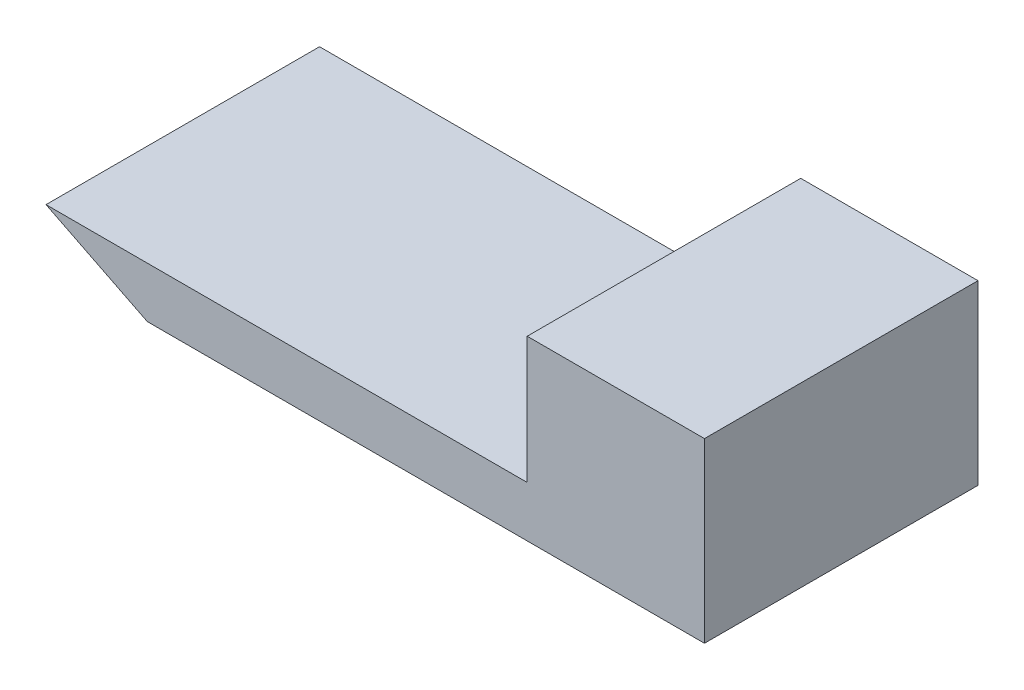
ISO-10303-21;
HEADER;
FILE_DESCRIPTION(('STEP AP214'),'2;1');
FILE_NAME('part.step','',(''),(''),'','','');
FILE_SCHEMA(('AUTOMOTIVE_DESIGN { 1 0 10303 214 1 1 1 1 }'));
ENDSEC;
DATA;
#1=APPLICATION_CONTEXT('core data for automotive mechanical design processes');
#2=APPLICATION_PROTOCOL_DEFINITION('international standard','automotive_design',2000,#1);
#3=PRODUCT_CONTEXT('',#1,'mechanical');
#4=PRODUCT('Part','Part','',(#3));
#5=PRODUCT_RELATED_PRODUCT_CATEGORY('part','',(#4));
#6=PRODUCT_DEFINITION_FORMATION('','',#4);
#7=PRODUCT_DEFINITION_CONTEXT('part definition',#1,'design');
#8=PRODUCT_DEFINITION('design','',#6,#7);
#9=PRODUCT_DEFINITION_SHAPE('','',#8);
#10=(LENGTH_UNIT() NAMED_UNIT(*) SI_UNIT(.MILLI.,.METRE.));
#11=(NAMED_UNIT(*) PLANE_ANGLE_UNIT() SI_UNIT($,.RADIAN.));
#12=(NAMED_UNIT(*) SI_UNIT($,.STERADIAN.) SOLID_ANGLE_UNIT());
#13=UNCERTAINTY_MEASURE_WITH_UNIT(LENGTH_MEASURE(1.E-05),#10,'distance_accuracy_value','');
#14=(GEOMETRIC_REPRESENTATION_CONTEXT(3) GLOBAL_UNCERTAINTY_ASSIGNED_CONTEXT((#13)) GLOBAL_UNIT_ASSIGNED_CONTEXT((#10,
#11,#12)) REPRESENTATION_CONTEXT('',''));
#15=CARTESIAN_POINT('',(0.,0.,0.));
#16=DIRECTION('',(0.,0.,1.));
#17=DIRECTION('',(1.,0.,0.));
#18=AXIS2_PLACEMENT_3D('',#15,#16,#17);
#19=CARTESIAN_POINT('',(-48.3861260844223,15.4542561887828,10.8));
#20=DIRECTION('',(0.,-1.,0.));
#21=DIRECTION('',(0.,0.,-1.));
#22=AXIS2_PLACEMENT_3D('',#19,#20,#21);
#23=PLANE('',#22);
#24=DIRECTION('',(-1.,0.,0.));
#25=VECTOR('',#24,1.);
#26=CARTESIAN_POINT('',(-48.3861260844223,15.4542561887828,0.));
#27=LINE('',#26,#25);
#28=CARTESIAN_POINT('',(-48.3861260844223,15.4542561887828,0.));
#29=VERTEX_POINT('',#28);
#30=CARTESIAN_POINT('',(-67.3861260844223,15.4542561887828,0.));
#31=VERTEX_POINT('',#30);
#32=EDGE_CURVE('E116',#29,#31,#27,.T.);
#33=ORIENTED_EDGE('',*,*,#32,.T.);
#34=DIRECTION('',(0.,0.,-1.));
#35=VECTOR('',#34,1.);
#36=CARTESIAN_POINT('',(-67.3861260844223,15.4542561887828,10.8));
#37=LINE('',#36,#35);
#38=CARTESIAN_POINT('',(-67.3861260844223,15.4542561887828,10.8));
#39=VERTEX_POINT('',#38);
#40=EDGE_CURVE('E11',#39,#31,#37,.T.);
#41=ORIENTED_EDGE('',*,*,#40,.F.);
#42=DIRECTION('',(-1.,0.,0.));
#43=VECTOR('',#42,1.);
#44=CARTESIAN_POINT('',(-48.3861260844223,15.4542561887828,10.8));
#45=LINE('',#44,#43);
#46=CARTESIAN_POINT('',(-48.3861260844223,15.4542561887828,10.8));
#47=VERTEX_POINT('',#46);
#48=EDGE_CURVE('E127',#47,#39,#45,.T.);
#49=ORIENTED_EDGE('',*,*,#48,.F.);
#50=DIRECTION('',(0.,0.,-1.));
#51=VECTOR('',#50,1.);
#52=CARTESIAN_POINT('',(-48.3861260844223,15.4542561887828,10.8));
#53=LINE('',#52,#51);
#54=EDGE_CURVE('E112',#47,#29,#53,.T.);
#55=ORIENTED_EDGE('',*,*,#54,.T.);
#56=EDGE_LOOP('',(#33,#41,#49,#55));
#57=FACE_BOUND('',#56,.T.);
#58=ADVANCED_FACE('F33',(#57),#23,.F.);
#59=CARTESIAN_POINT('',(-67.3861260844223,15.4542561887828,10.8));
#60=DIRECTION('',(0.447213595499958,0.894427190999916,0.));
#61=DIRECTION('',(-0.894427190999916,0.447213595499958,0.));
#62=AXIS2_PLACEMENT_3D('',#59,#60,#61);
#63=PLANE('',#62);
#64=DIRECTION('',(0.894427190999916,-0.447213595499958,0.));
#65=VECTOR('',#64,1.);
#66=CARTESIAN_POINT('',(-67.3861260844223,15.4542561887828,0.));
#67=LINE('',#66,#65);
#68=CARTESIAN_POINT('',(-63.3861260844223,13.4542561887828,0.));
#69=VERTEX_POINT('',#68);
#70=EDGE_CURVE('E119',#31,#69,#67,.T.);
#71=ORIENTED_EDGE('',*,*,#70,.T.);
#72=DIRECTION('',(0.,0.,-1.));
#73=VECTOR('',#72,1.);
#74=CARTESIAN_POINT('',(-63.3861260844223,13.4542561887828,10.8));
#75=LINE('',#74,#73);
#76=CARTESIAN_POINT('',(-63.3861260844223,13.4542561887828,10.8));
#77=VERTEX_POINT('',#76);
#78=EDGE_CURVE('E41',#77,#69,#75,.T.);
#79=ORIENTED_EDGE('',*,*,#78,.F.);
#80=DIRECTION('',(0.894427190999916,-0.447213595499958,0.));
#81=VECTOR('',#80,1.);
#82=CARTESIAN_POINT('',(-67.3861260844223,15.4542561887828,10.8));
#83=LINE('',#82,#81);
#84=EDGE_CURVE('E86',#39,#77,#83,.T.);
#85=ORIENTED_EDGE('',*,*,#84,.F.);
#86=ORIENTED_EDGE('',*,*,#40,.T.);
#87=EDGE_LOOP('',(#71,#79,#85,#86));
#88=FACE_BOUND('',#87,.T.);
#89=ADVANCED_FACE('F151',(#88),#63,.F.);
#90=CARTESIAN_POINT('',(-41.3861260844223,13.4542561887828,10.8));
#91=DIRECTION('',(0.,1.,0.));
#92=DIRECTION('',(-1.,0.,0.));
#93=AXIS2_PLACEMENT_3D('',#90,#91,#92);
#94=PLANE('',#93);
#95=DIRECTION('',(1.,0.,0.));
#96=VECTOR('',#95,1.);
#97=CARTESIAN_POINT('',(-41.3861260844223,13.4542561887828,0.));
#98=LINE('',#97,#96);
#99=CARTESIAN_POINT('',(-41.3861260844223,13.4542561887828,0.));
#100=VERTEX_POINT('',#99);
#101=EDGE_CURVE('E121',#69,#100,#98,.T.);
#102=ORIENTED_EDGE('',*,*,#101,.T.);
#103=DIRECTION('',(0.,0.,-1.));
#104=VECTOR('',#103,1.);
#105=CARTESIAN_POINT('',(-41.3861260844223,13.4542561887828,10.8));
#106=LINE('',#105,#104);
#107=CARTESIAN_POINT('',(-41.3861260844223,13.4542561887828,10.8));
#108=VERTEX_POINT('',#107);
#109=EDGE_CURVE('E107',#108,#100,#106,.T.);
#110=ORIENTED_EDGE('',*,*,#109,.F.);
#111=DIRECTION('',(1.,0.,0.));
#112=VECTOR('',#111,1.);
#113=CARTESIAN_POINT('',(-41.3861260844223,13.4542561887828,10.8));
#114=LINE('',#113,#112);
#115=EDGE_CURVE('E99',#77,#108,#114,.T.);
#116=ORIENTED_EDGE('',*,*,#115,.F.);
#117=ORIENTED_EDGE('',*,*,#78,.T.);
#118=EDGE_LOOP('',(#102,#110,#116,#117));
#119=FACE_BOUND('',#118,.T.);
#120=ADVANCED_FACE('F133',(#119),#94,.F.);
#121=CARTESIAN_POINT('',(-41.3861260844223,15.4542561887828,10.8));
#122=DIRECTION('',(-1.,0.,0.));
#123=DIRECTION('',(0.,0.,1.));
#124=AXIS2_PLACEMENT_3D('',#121,#122,#123);
#125=PLANE('',#124);
#126=DIRECTION('',(0.,1.,0.));
#127=VECTOR('',#126,1.);
#128=CARTESIAN_POINT('',(-41.3861260844223,15.4542561887828,0.));
#129=LINE('',#128,#127);
#130=CARTESIAN_POINT('',(-41.3861260844223,20.4542561887828,0.));
#131=VERTEX_POINT('',#130);
#132=EDGE_CURVE('E106',#100,#131,#129,.T.);
#133=ORIENTED_EDGE('',*,*,#132,.T.);
#134=DIRECTION('',(0.,0.,-1.));
#135=VECTOR('',#134,1.);
#136=CARTESIAN_POINT('',(-41.3861260844223,20.4542561887828,10.8));
#137=LINE('',#136,#135);
#138=CARTESIAN_POINT('',(-41.3861260844223,20.4542561887828,10.8));
#139=VERTEX_POINT('',#138);
#140=EDGE_CURVE('E104',#139,#131,#137,.T.);
#141=ORIENTED_EDGE('',*,*,#140,.F.);
#142=DIRECTION('',(0.,1.,0.));
#143=VECTOR('',#142,1.);
#144=CARTESIAN_POINT('',(-41.3861260844223,15.4542561887828,10.8));
#145=LINE('',#144,#143);
#146=EDGE_CURVE('E93',#108,#139,#145,.T.);
#147=ORIENTED_EDGE('',*,*,#146,.F.);
#148=ORIENTED_EDGE('',*,*,#109,.T.);
#149=EDGE_LOOP('',(#133,#141,#147,#148));
#150=FACE_BOUND('',#149,.T.);
#151=ADVANCED_FACE('F105',(#150),#125,.F.);
#152=CARTESIAN_POINT('',(-41.3861260844223,20.4542561887828,10.8));
#153=DIRECTION('',(0.,-1.,0.));
#154=DIRECTION('',(0.,0.,-1.));
#155=AXIS2_PLACEMENT_3D('',#152,#153,#154);
#156=PLANE('',#155);
#157=DIRECTION('',(-1.,0.,0.));
#158=VECTOR('',#157,1.);
#159=CARTESIAN_POINT('',(-41.3861260844223,20.4542561887828,0.));
#160=LINE('',#159,#158);
#161=CARTESIAN_POINT('',(-48.3861260844223,20.4542561887828,0.));
#162=VERTEX_POINT('',#161);
#163=EDGE_CURVE('E72',#131,#162,#160,.T.);
#164=ORIENTED_EDGE('',*,*,#163,.T.);
#165=DIRECTION('',(0.,0.,-1.));
#166=VECTOR('',#165,1.);
#167=CARTESIAN_POINT('',(-48.3861260844223,20.4542561887828,10.8));
#168=LINE('',#167,#166);
#169=CARTESIAN_POINT('',(-48.3861260844223,20.4542561887828,10.8));
#170=VERTEX_POINT('',#169);
#171=EDGE_CURVE('E108',#170,#162,#168,.T.);
#172=ORIENTED_EDGE('',*,*,#171,.F.);
#173=DIRECTION('',(-1.,0.,0.));
#174=VECTOR('',#173,1.);
#175=CARTESIAN_POINT('',(-41.3861260844223,20.4542561887828,10.8));
#176=LINE('',#175,#174);
#177=EDGE_CURVE('E97',#139,#170,#176,.T.);
#178=ORIENTED_EDGE('',*,*,#177,.F.);
#179=ORIENTED_EDGE('',*,*,#140,.T.);
#180=EDGE_LOOP('',(#164,#172,#178,#179));
#181=FACE_BOUND('',#180,.T.);
#182=ADVANCED_FACE('F110',(#181),#156,.F.);
#183=CARTESIAN_POINT('',(-48.3861260844223,20.4542561887828,10.8));
#184=DIRECTION('',(1.,0.,0.));
#185=DIRECTION('',(0.,0.,-1.));
#186=AXIS2_PLACEMENT_3D('',#183,#184,#185);
#187=PLANE('',#186);
#188=DIRECTION('',(0.,-1.,0.));
#189=VECTOR('',#188,1.);
#190=CARTESIAN_POINT('',(-48.3861260844223,20.4542561887828,0.));
#191=LINE('',#190,#189);
#192=EDGE_CURVE('E78',#162,#29,#191,.T.);
#193=ORIENTED_EDGE('',*,*,#192,.T.);
#194=ORIENTED_EDGE('',*,*,#54,.F.);
#195=DIRECTION('',(0.,-1.,0.));
#196=VECTOR('',#195,1.);
#197=CARTESIAN_POINT('',(-48.3861260844223,20.4542561887828,10.8));
#198=LINE('',#197,#196);
#199=EDGE_CURVE('E49',#170,#47,#198,.T.);
#200=ORIENTED_EDGE('',*,*,#199,.F.);
#201=ORIENTED_EDGE('',*,*,#171,.T.);
#202=EDGE_LOOP('',(#193,#194,#200,#201));
#203=FACE_BOUND('',#202,.T.);
#204=ADVANCED_FACE('F140',(#203),#187,.F.);
#205=CARTESIAN_POINT('',(0.,0.,10.8));
#206=DIRECTION('',(0.,0.,1.));
#207=DIRECTION('',(1.,0.,0.));
#208=AXIS2_PLACEMENT_3D('',#205,#206,#207);
#209=PLANE('',#208);
#210=ORIENTED_EDGE('',*,*,#48,.T.);
#211=ORIENTED_EDGE('',*,*,#84,.T.);
#212=ORIENTED_EDGE('',*,*,#115,.T.);
#213=ORIENTED_EDGE('',*,*,#146,.T.);
#214=ORIENTED_EDGE('',*,*,#177,.T.);
#215=ORIENTED_EDGE('',*,*,#199,.T.);
#216=EDGE_LOOP('',(#210,#211,#212,#213,#214,#215));
#217=FACE_BOUND('',#216,.T.);
#218=ADVANCED_FACE('F95',(#217),#209,.T.);
#219=CARTESIAN_POINT('',(0.,0.,0.));
#220=DIRECTION('',(0.,0.,1.));
#221=DIRECTION('',(1.,0.,0.));
#222=AXIS2_PLACEMENT_3D('',#219,#220,#221);
#223=PLANE('',#222);
#224=ORIENTED_EDGE('',*,*,#32,.F.);
#225=ORIENTED_EDGE('',*,*,#192,.F.);
#226=ORIENTED_EDGE('',*,*,#163,.F.);
#227=ORIENTED_EDGE('',*,*,#132,.F.);
#228=ORIENTED_EDGE('',*,*,#101,.F.);
#229=ORIENTED_EDGE('',*,*,#70,.F.);
#230=EDGE_LOOP('',(#224,#225,#226,#227,#228,#229));
#231=FACE_BOUND('',#230,.T.);
#232=ADVANCED_FACE('F136',(#231),#223,.F.);
#233=CLOSED_SHELL('',(#58,#89,#120,#151,#182,#204,#218,#232));
#234=MANIFOLD_SOLID_BREP('B2',#233);
#235=ADVANCED_BREP_SHAPE_REPRESENTATION('',(#18,#234),#14);
#236=SHAPE_DEFINITION_REPRESENTATION(#9,#235);
ENDSEC;
END-ISO-10303-21;
